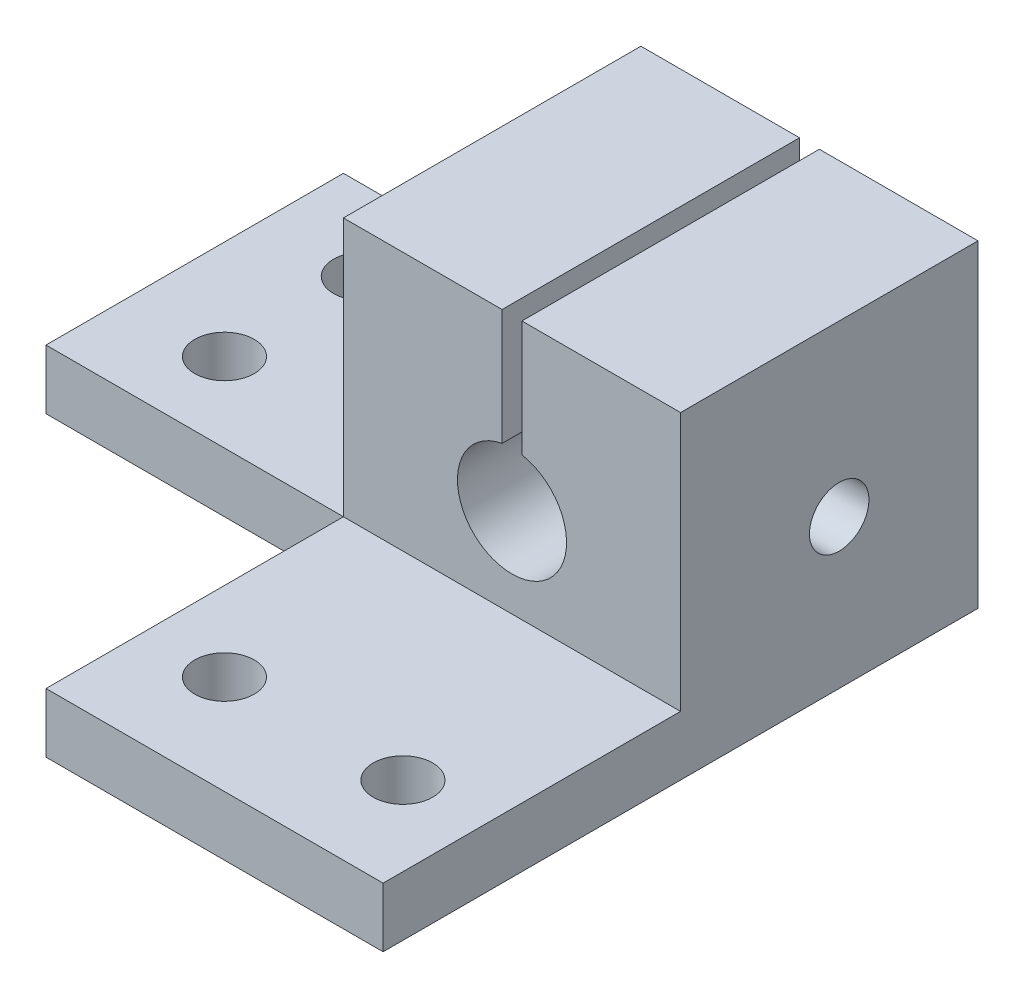
ISO-10303-21;
HEADER;
FILE_DESCRIPTION(('STEP AP214'),'2;1');
FILE_NAME('part.step','',(''),(''),'','','');
FILE_SCHEMA(('AUTOMOTIVE_DESIGN { 1 0 10303 214 1 1 1 1 }'));
ENDSEC;
DATA;
#1=APPLICATION_CONTEXT('core data for automotive mechanical design processes');
#2=APPLICATION_PROTOCOL_DEFINITION('international standard','automotive_design',2000,#1);
#3=PRODUCT_CONTEXT('',#1,'mechanical');
#4=PRODUCT('Part','Part','',(#3));
#5=PRODUCT_RELATED_PRODUCT_CATEGORY('part','',(#4));
#6=PRODUCT_DEFINITION_FORMATION('','',#4);
#7=PRODUCT_DEFINITION_CONTEXT('part definition',#1,'design');
#8=PRODUCT_DEFINITION('design','',#6,#7);
#9=PRODUCT_DEFINITION_SHAPE('','',#8);
#10=(LENGTH_UNIT() NAMED_UNIT(*) SI_UNIT(.MILLI.,.METRE.));
#11=(NAMED_UNIT(*) PLANE_ANGLE_UNIT() SI_UNIT($,.RADIAN.));
#12=(NAMED_UNIT(*) SI_UNIT($,.STERADIAN.) SOLID_ANGLE_UNIT());
#13=UNCERTAINTY_MEASURE_WITH_UNIT(LENGTH_MEASURE(1.E-05),#10,'distance_accuracy_value','');
#14=(GEOMETRIC_REPRESENTATION_CONTEXT(3) GLOBAL_UNCERTAINTY_ASSIGNED_CONTEXT((#13)) GLOBAL_UNIT_ASSIGNED_CONTEXT((#10,
#11,#12)) REPRESENTATION_CONTEXT('',''));
#15=CARTESIAN_POINT('',(0.,0.,0.));
#16=DIRECTION('',(0.,0.,1.));
#17=DIRECTION('',(1.,0.,0.));
#18=AXIS2_PLACEMENT_3D('',#15,#16,#17);
#19=CARTESIAN_POINT('',(-8.5,20.,0.));
#20=DIRECTION('',(-1.,0.,0.));
#21=DIRECTION('',(0.,0.,1.));
#22=AXIS2_PLACEMENT_3D('',#19,#20,#21);
#23=PLANE('',#22);
#24=DIRECTION('',(0.,0.,-1.));
#25=VECTOR('',#24,1.);
#26=CARTESIAN_POINT('',(-8.5,3.,-7.5));
#27=LINE('',#26,#25);
#28=CARTESIAN_POINT('',(-8.5,3.,7.5));
#29=VERTEX_POINT('',#28);
#30=CARTESIAN_POINT('',(-8.5,3.,-7.5));
#31=VERTEX_POINT('',#30);
#32=EDGE_CURVE('E153',#29,#31,#27,.T.);
#33=ORIENTED_EDGE('',*,*,#32,.F.);
#34=DIRECTION('',(0.,-1.,0.));
#35=VECTOR('',#34,1.);
#36=CARTESIAN_POINT('',(-8.5,20.,7.5));
#37=LINE('',#36,#35);
#38=CARTESIAN_POINT('',(-8.5,16.051646402671,7.5));
#39=VERTEX_POINT('',#38);
#40=EDGE_CURVE('E230',#39,#29,#37,.T.);
#41=ORIENTED_EDGE('',*,*,#40,.F.);
#42=DIRECTION('',(0.,0.,1.));
#43=VECTOR('',#42,1.);
#44=CARTESIAN_POINT('',(-8.5,16.051646402671,-27.5));
#45=LINE('',#44,#43);
#46=CARTESIAN_POINT('',(-8.5,16.051646402671,-7.5));
#47=VERTEX_POINT('',#46);
#48=EDGE_CURVE('E184',#47,#39,#45,.T.);
#49=ORIENTED_EDGE('',*,*,#48,.F.);
#50=DIRECTION('',(0.,-1.,0.));
#51=VECTOR('',#50,1.);
#52=CARTESIAN_POINT('',(-8.5,20.,-7.5));
#53=LINE('',#52,#51);
#54=EDGE_CURVE('E61',#47,#31,#53,.T.);
#55=ORIENTED_EDGE('',*,*,#54,.T.);
#56=EDGE_LOOP('',(#33,#41,#49,#55));
#57=FACE_BOUND('',#56,.T.);
#58=CARTESIAN_POINT('',(-8.5,7.5,-0.499999999999999));
#59=DIRECTION('',(-1.,0.,0.));
#60=DIRECTION('',(0.,0.,1.));
#61=AXIS2_PLACEMENT_3D('',#58,#59,#60);
#62=CIRCLE('',#61,1.5);
#63=CARTESIAN_POINT('',(-8.5,7.5,1.));
#64=VERTEX_POINT('',#63);
#65=EDGE_CURVE('E196',#64,#64,#62,.T.);
#66=ORIENTED_EDGE('',*,*,#65,.F.);
#67=EDGE_LOOP('',(#66));
#68=FACE_BOUND('',#67,.T.);
#69=ADVANCED_FACE('F36',(#57,#68),#23,.T.);
#70=CARTESIAN_POINT('',(0.,20.,7.5));
#71=DIRECTION('',(0.,0.,-1.));
#72=DIRECTION('',(-1.,0.,0.));
#73=AXIS2_PLACEMENT_3D('',#70,#71,#72);
#74=PLANE('',#73);
#75=DIRECTION('',(-1.,0.,0.));
#76=VECTOR('',#75,1.);
#77=CARTESIAN_POINT('',(8.5,3.,7.5));
#78=LINE('',#77,#76);
#79=CARTESIAN_POINT('',(8.5,3.,7.5));
#80=VERTEX_POINT('',#79);
#81=EDGE_CURVE('E154',#80,#29,#78,.T.);
#82=ORIENTED_EDGE('',*,*,#81,.F.);
#83=DIRECTION('',(0.,-1.,0.));
#84=VECTOR('',#83,1.);
#85=CARTESIAN_POINT('',(8.5,20.,7.5));
#86=LINE('',#85,#84);
#87=CARTESIAN_POINT('',(8.5,16.051646402671,7.5));
#88=VERTEX_POINT('',#87);
#89=EDGE_CURVE('E236',#88,#80,#86,.T.);
#90=ORIENTED_EDGE('',*,*,#89,.F.);
#91=DIRECTION('',(-1.,0.,0.));
#92=VECTOR('',#91,1.);
#93=CARTESIAN_POINT('',(0.,16.051646402671,7.5));
#94=LINE('',#93,#92);
#95=CARTESIAN_POINT('',(0.499999999999999,16.051646402671,7.5));
#96=VERTEX_POINT('',#95);
#97=EDGE_CURVE('E180',#88,#96,#94,.T.);
#98=ORIENTED_EDGE('',*,*,#97,.T.);
#99=DIRECTION('',(0.,-1.,0.));
#100=VECTOR('',#99,1.);
#101=CARTESIAN_POINT('',(0.499999999999999,20.,7.5));
#102=LINE('',#101,#100);
#103=CARTESIAN_POINT('',(0.499999999999999,10.204163456598,7.5));
#104=VERTEX_POINT('',#103);
#105=EDGE_CURVE('E219',#96,#104,#102,.T.);
#106=ORIENTED_EDGE('',*,*,#105,.T.);
#107=CARTESIAN_POINT('',(0.,7.5,7.5));
#108=DIRECTION('',(0.,0.,-1.));
#109=DIRECTION('',(-1.,0.,0.));
#110=AXIS2_PLACEMENT_3D('',#107,#108,#109);
#111=CIRCLE('',#110,2.75);
#112=CARTESIAN_POINT('',(-0.499999999999999,10.204163456598,7.5));
#113=VERTEX_POINT('',#112);
#114=EDGE_CURVE('E221',#104,#113,#111,.T.);
#115=ORIENTED_EDGE('',*,*,#114,.T.);
#116=DIRECTION('',(0.,-1.,0.));
#117=VECTOR('',#116,1.);
#118=CARTESIAN_POINT('',(-0.500000000000002,20.,7.5));
#119=LINE('',#118,#117);
#120=CARTESIAN_POINT('',(-0.500000000000001,16.051646402671,7.5));
#121=VERTEX_POINT('',#120);
#122=EDGE_CURVE('E215',#121,#113,#119,.T.);
#123=ORIENTED_EDGE('',*,*,#122,.F.);
#124=DIRECTION('',(-1.,0.,0.));
#125=VECTOR('',#124,1.);
#126=CARTESIAN_POINT('',(0.,16.051646402671,7.5));
#127=LINE('',#126,#125);
#128=EDGE_CURVE('E179',#121,#39,#127,.T.);
#129=ORIENTED_EDGE('',*,*,#128,.T.);
#130=ORIENTED_EDGE('',*,*,#40,.T.);
#131=EDGE_LOOP('',(#82,#90,#98,#106,#115,#123,#129,#130));
#132=FACE_BOUND('',#131,.T.);
#133=ADVANCED_FACE('F38',(#132),#74,.F.);
#134=CARTESIAN_POINT('',(8.5,20.,0.));
#135=DIRECTION('',(-1.,0.,0.));
#136=DIRECTION('',(0.,0.,1.));
#137=AXIS2_PLACEMENT_3D('',#134,#135,#136);
#138=PLANE('',#137);
#139=CARTESIAN_POINT('',(8.5,7.5,-0.499999999999999));
#140=DIRECTION('',(-1.,0.,0.));
#141=DIRECTION('',(0.,0.,1.));
#142=AXIS2_PLACEMENT_3D('',#139,#140,#141);
#143=CIRCLE('',#142,1.5);
#144=CARTESIAN_POINT('',(8.5,7.5,1.));
#145=VERTEX_POINT('',#144);
#146=EDGE_CURVE('E200',#145,#145,#143,.T.);
#147=ORIENTED_EDGE('',*,*,#146,.T.);
#148=EDGE_LOOP('',(#147));
#149=FACE_BOUND('',#148,.T.);
#150=DIRECTION('',(0.,0.,1.));
#151=VECTOR('',#150,1.);
#152=CARTESIAN_POINT('',(8.5,16.051646402671,-27.5));
#153=LINE('',#152,#151);
#154=CARTESIAN_POINT('',(8.5,16.051646402671,-7.5));
#155=VERTEX_POINT('',#154);
#156=EDGE_CURVE('E183',#155,#88,#153,.T.);
#157=ORIENTED_EDGE('',*,*,#156,.T.);
#158=ORIENTED_EDGE('',*,*,#89,.T.);
#159=DIRECTION('',(0.,0.,-1.));
#160=VECTOR('',#159,1.);
#161=CARTESIAN_POINT('',(8.5,3.,22.5));
#162=LINE('',#161,#160);
#163=CARTESIAN_POINT('',(8.5,3.,22.5));
#164=VERTEX_POINT('',#163);
#165=EDGE_CURVE('E176',#164,#80,#162,.T.);
#166=ORIENTED_EDGE('',*,*,#165,.F.);
#167=DIRECTION('',(0.,1.,0.));
#168=VECTOR('',#167,1.);
#169=CARTESIAN_POINT('',(8.5,0.,22.5));
#170=LINE('',#169,#168);
#171=CARTESIAN_POINT('',(8.5,0.,22.5));
#172=VERTEX_POINT('',#171);
#173=EDGE_CURVE('E167',#172,#164,#170,.T.);
#174=ORIENTED_EDGE('',*,*,#173,.F.);
#175=DIRECTION('',(0.,0.,-1.));
#176=VECTOR('',#175,1.);
#177=CARTESIAN_POINT('',(8.5,0.,0.));
#178=LINE('',#177,#176);
#179=CARTESIAN_POINT('',(8.5,0.,-7.5));
#180=VERTEX_POINT('',#179);
#181=EDGE_CURVE('E224',#172,#180,#178,.T.);
#182=ORIENTED_EDGE('',*,*,#181,.T.);
#183=DIRECTION('',(0.,-1.,0.));
#184=VECTOR('',#183,1.);
#185=CARTESIAN_POINT('',(8.5,20.,-7.5));
#186=LINE('',#185,#184);
#187=EDGE_CURVE('E234',#155,#180,#186,.T.);
#188=ORIENTED_EDGE('',*,*,#187,.F.);
#189=EDGE_LOOP('',(#157,#158,#166,#174,#182,#188));
#190=FACE_BOUND('',#189,.T.);
#191=ADVANCED_FACE('F282',(#149,#190),#138,.F.);
#192=CARTESIAN_POINT('',(0.,20.,-7.5));
#193=DIRECTION('',(0.,0.,-1.));
#194=DIRECTION('',(-1.,0.,0.));
#195=AXIS2_PLACEMENT_3D('',#192,#193,#194);
#196=PLANE('',#195);
#197=DIRECTION('',(0.,-1.,0.));
#198=VECTOR('',#197,1.);
#199=CARTESIAN_POINT('',(0.499999999999999,0.,-7.5));
#200=LINE('',#199,#198);
#201=CARTESIAN_POINT('',(0.499999999999999,16.051646402671,-7.5));
#202=VERTEX_POINT('',#201);
#203=CARTESIAN_POINT('',(0.499999999999999,10.204163456598,-7.5));
#204=VERTEX_POINT('',#203);
#205=EDGE_CURVE('E209',#202,#204,#200,.T.);
#206=ORIENTED_EDGE('',*,*,#205,.F.);
#207=DIRECTION('',(1.,0.,0.));
#208=VECTOR('',#207,1.);
#209=CARTESIAN_POINT('',(0.,16.051646402671,-7.5));
#210=LINE('',#209,#208);
#211=EDGE_CURVE('E193',#202,#155,#210,.T.);
#212=ORIENTED_EDGE('',*,*,#211,.T.);
#213=ORIENTED_EDGE('',*,*,#187,.T.);
#214=DIRECTION('',(1.,0.,0.));
#215=VECTOR('',#214,1.);
#216=CARTESIAN_POINT('',(0.,0.,-7.5));
#217=LINE('',#216,#215);
#218=CARTESIAN_POINT('',(-23.5,0.,-7.5));
#219=VERTEX_POINT('',#218);
#220=EDGE_CURVE('E138',#219,#180,#217,.T.);
#221=ORIENTED_EDGE('',*,*,#220,.F.);
#222=DIRECTION('',(0.,-1.,0.));
#223=VECTOR('',#222,1.);
#224=CARTESIAN_POINT('',(-23.5,0.,-7.5));
#225=LINE('',#224,#223);
#226=CARTESIAN_POINT('',(-23.5,3.,-7.5));
#227=VERTEX_POINT('',#226);
#228=EDGE_CURVE('E130',#227,#219,#225,.T.);
#229=ORIENTED_EDGE('',*,*,#228,.F.);
#230=DIRECTION('',(1.,0.,0.));
#231=VECTOR('',#230,1.);
#232=CARTESIAN_POINT('',(-23.5,3.,-7.5));
#233=LINE('',#232,#231);
#234=EDGE_CURVE('E135',#227,#31,#233,.T.);
#235=ORIENTED_EDGE('',*,*,#234,.T.);
#236=ORIENTED_EDGE('',*,*,#54,.F.);
#237=DIRECTION('',(1.,0.,0.));
#238=VECTOR('',#237,1.);
#239=CARTESIAN_POINT('',(0.,16.051646402671,-7.5));
#240=LINE('',#239,#238);
#241=CARTESIAN_POINT('',(-0.500000000000001,16.051646402671,-7.5));
#242=VERTEX_POINT('',#241);
#243=EDGE_CURVE('E187',#47,#242,#240,.T.);
#244=ORIENTED_EDGE('',*,*,#243,.T.);
#245=DIRECTION('',(0.,-1.,0.));
#246=VECTOR('',#245,1.);
#247=CARTESIAN_POINT('',(-0.499999999999996,0.,-7.5));
#248=LINE('',#247,#246);
#249=CARTESIAN_POINT('',(-0.499999999999999,10.204163456598,-7.5));
#250=VERTEX_POINT('',#249);
#251=EDGE_CURVE('E207',#242,#250,#248,.T.);
#252=ORIENTED_EDGE('',*,*,#251,.T.);
#253=CARTESIAN_POINT('',(0.,7.5,-7.5));
#254=DIRECTION('',(0.,0.,-1.));
#255=DIRECTION('',(-1.,0.,0.));
#256=AXIS2_PLACEMENT_3D('',#253,#254,#255);
#257=CIRCLE('',#256,2.75);
#258=EDGE_CURVE('E203',#204,#250,#257,.T.);
#259=ORIENTED_EDGE('',*,*,#258,.F.);
#260=EDGE_LOOP('',(#206,#212,#213,#221,#229,#235,#236,#244,#252,#259));
#261=FACE_BOUND('',#260,.T.);
#262=ADVANCED_FACE('F133',(#261),#196,.T.);
#263=DIRECTION('',(0.,1.,0.));
#264=VECTOR('',#263,1.);
#265=CARTESIAN_POINT('',(-8.5,3.,7.5));
#266=LINE('',#265,#264);
#267=CARTESIAN_POINT('',(-8.5,0.,7.5));
#268=VERTEX_POINT('',#267);
#269=EDGE_CURVE('E53',#268,#29,#266,.T.);
#270=ORIENTED_EDGE('',*,*,#269,.F.);
#271=DIRECTION('',(0.,0.,-1.));
#272=VECTOR('',#271,1.);
#273=CARTESIAN_POINT('',(-8.5,0.,0.));
#274=LINE('',#273,#272);
#275=CARTESIAN_POINT('',(-8.5,0.,22.5));
#276=VERTEX_POINT('',#275);
#277=EDGE_CURVE('E228',#276,#268,#274,.T.);
#278=ORIENTED_EDGE('',*,*,#277,.F.);
#279=DIRECTION('',(0.,-1.,0.));
#280=VECTOR('',#279,1.);
#281=CARTESIAN_POINT('',(-8.5,3.,22.5));
#282=LINE('',#281,#280);
#283=CARTESIAN_POINT('',(-8.5,3.,22.5));
#284=VERTEX_POINT('',#283);
#285=EDGE_CURVE('E171',#284,#276,#282,.T.);
#286=ORIENTED_EDGE('',*,*,#285,.F.);
#287=DIRECTION('',(0.,0.,-1.));
#288=VECTOR('',#287,1.);
#289=CARTESIAN_POINT('',(-8.5,3.,22.5));
#290=LINE('',#289,#288);
#291=EDGE_CURVE('E173',#284,#29,#290,.T.);
#292=ORIENTED_EDGE('',*,*,#291,.T.);
#293=EDGE_LOOP('',(#270,#278,#286,#292));
#294=FACE_BOUND('',#293,.T.);
#295=ADVANCED_FACE('F267',(#294),#23,.T.);
#296=CARTESIAN_POINT('',(0.499999999999999,0.,12.5));
#297=DIRECTION('',(1.,0.,0.));
#298=DIRECTION('',(0.,1.,0.));
#299=AXIS2_PLACEMENT_3D('',#296,#297,#298);
#300=PLANE('',#299);
#301=DIRECTION('',(0.,0.,1.));
#302=VECTOR('',#301,1.);
#303=CARTESIAN_POINT('',(0.499999999999999,16.051646402671,12.5));
#304=LINE('',#303,#302);
#305=EDGE_CURVE('E12',#202,#96,#304,.T.);
#306=ORIENTED_EDGE('',*,*,#305,.F.);
#307=ORIENTED_EDGE('',*,*,#205,.T.);
#308=DIRECTION('',(0.,0.,-1.));
#309=VECTOR('',#308,1.);
#310=CARTESIAN_POINT('',(0.499999999999999,10.204163456598,12.5));
#311=LINE('',#310,#309);
#312=EDGE_CURVE('E212',#104,#204,#311,.T.);
#313=ORIENTED_EDGE('',*,*,#312,.F.);
#314=ORIENTED_EDGE('',*,*,#105,.F.);
#315=EDGE_LOOP('',(#306,#307,#313,#314));
#316=FACE_BOUND('',#315,.T.);
#317=ADVANCED_FACE('F263',(#316),#300,.F.);
#318=CARTESIAN_POINT('',(-0.499999999999996,0.,12.5));
#319=DIRECTION('',(1.,0.,0.));
#320=DIRECTION('',(0.,1.,0.));
#321=AXIS2_PLACEMENT_3D('',#318,#319,#320);
#322=PLANE('',#321);
#323=ORIENTED_EDGE('',*,*,#251,.F.);
#324=DIRECTION('',(0.,0.,1.));
#325=VECTOR('',#324,1.);
#326=CARTESIAN_POINT('',(-0.500000000000001,16.051646402671,12.5));
#327=LINE('',#326,#325);
#328=EDGE_CURVE('E45',#242,#121,#327,.T.);
#329=ORIENTED_EDGE('',*,*,#328,.T.);
#330=ORIENTED_EDGE('',*,*,#122,.T.);
#331=DIRECTION('',(0.,0.,-1.));
#332=VECTOR('',#331,1.);
#333=CARTESIAN_POINT('',(-0.499999999999999,10.204163456598,12.5));
#334=LINE('',#333,#332);
#335=EDGE_CURVE('E211',#113,#250,#334,.T.);
#336=ORIENTED_EDGE('',*,*,#335,.T.);
#337=EDGE_LOOP('',(#323,#329,#330,#336));
#338=FACE_BOUND('',#337,.T.);
#339=ADVANCED_FACE('F266',(#338),#322,.T.);
#340=CARTESIAN_POINT('',(0.,0.,0.));
#341=DIRECTION('',(0.,1.,0.));
#342=DIRECTION('',(0.,0.,1.));
#343=AXIS2_PLACEMENT_3D('',#340,#341,#342);
#344=PLANE('',#343);
#345=CARTESIAN_POINT('',(4.5,0.,17.5));
#346=DIRECTION('',(0.,-1.,0.));
#347=DIRECTION('',(0.,0.,-1.));
#348=AXIS2_PLACEMENT_3D('',#345,#346,#347);
#349=CIRCLE('',#348,1.5);
#350=CARTESIAN_POINT('',(4.5,0.,16.));
#351=VERTEX_POINT('',#350);
#352=EDGE_CURVE('E396',#351,#351,#349,.T.);
#353=ORIENTED_EDGE('',*,*,#352,.F.);
#354=EDGE_LOOP('',(#353));
#355=FACE_BOUND('',#354,.T.);
#356=CARTESIAN_POINT('',(-4.5,0.,17.5));
#357=DIRECTION('',(0.,-1.,0.));
#358=DIRECTION('',(0.,0.,-1.));
#359=AXIS2_PLACEMENT_3D('',#356,#357,#358);
#360=CIRCLE('',#359,1.5);
#361=CARTESIAN_POINT('',(-4.5,0.,16.));
#362=VERTEX_POINT('',#361);
#363=EDGE_CURVE('E393',#362,#362,#360,.T.);
#364=ORIENTED_EDGE('',*,*,#363,.F.);
#365=EDGE_LOOP('',(#364));
#366=FACE_BOUND('',#365,.T.);
#367=CARTESIAN_POINT('',(-18.5,0.,-3.5));
#368=DIRECTION('',(0.,-1.,0.));
#369=DIRECTION('',(0.,0.,-1.));
#370=AXIS2_PLACEMENT_3D('',#367,#368,#369);
#371=CIRCLE('',#370,1.5);
#372=CARTESIAN_POINT('',(-18.5,0.,-5.));
#373=VERTEX_POINT('',#372);
#374=EDGE_CURVE('E390',#373,#373,#371,.T.);
#375=ORIENTED_EDGE('',*,*,#374,.F.);
#376=EDGE_LOOP('',(#375));
#377=FACE_BOUND('',#376,.T.);
#378=CARTESIAN_POINT('',(-18.5,0.,3.5));
#379=DIRECTION('',(0.,-1.,0.));
#380=DIRECTION('',(0.,0.,-1.));
#381=AXIS2_PLACEMENT_3D('',#378,#379,#380);
#382=CIRCLE('',#381,1.5);
#383=CARTESIAN_POINT('',(-18.5,0.,2.));
#384=VERTEX_POINT('',#383);
#385=EDGE_CURVE('E356',#384,#384,#382,.T.);
#386=ORIENTED_EDGE('',*,*,#385,.F.);
#387=EDGE_LOOP('',(#386));
#388=FACE_BOUND('',#387,.T.);
#389=ORIENTED_EDGE('',*,*,#181,.F.);
#390=DIRECTION('',(1.,0.,0.));
#391=VECTOR('',#390,1.);
#392=CARTESIAN_POINT('',(-8.5,0.,22.5));
#393=LINE('',#392,#391);
#394=EDGE_CURVE('E158',#276,#172,#393,.T.);
#395=ORIENTED_EDGE('',*,*,#394,.F.);
#396=ORIENTED_EDGE('',*,*,#277,.T.);
#397=DIRECTION('',(1.,0.,0.));
#398=VECTOR('',#397,1.);
#399=CARTESIAN_POINT('',(-23.5,0.,7.5));
#400=LINE('',#399,#398);
#401=CARTESIAN_POINT('',(-23.5,0.,7.5));
#402=VERTEX_POINT('',#401);
#403=EDGE_CURVE('E155',#402,#268,#400,.T.);
#404=ORIENTED_EDGE('',*,*,#403,.F.);
#405=DIRECTION('',(0.,0.,1.));
#406=VECTOR('',#405,1.);
#407=CARTESIAN_POINT('',(-23.5,0.,7.5));
#408=LINE('',#407,#406);
#409=EDGE_CURVE('E141',#219,#402,#408,.T.);
#410=ORIENTED_EDGE('',*,*,#409,.F.);
#411=ORIENTED_EDGE('',*,*,#220,.T.);
#412=EDGE_LOOP('',(#389,#395,#396,#404,#410,#411));
#413=FACE_BOUND('',#412,.T.);
#414=ADVANCED_FACE('F270',(#355,#366,#377,#388,#413),#344,.F.);
#415=CARTESIAN_POINT('',(0.,7.5,12.5));
#416=DIRECTION('',(0.,0.,-1.));
#417=DIRECTION('',(-1.,0.,0.));
#418=AXIS2_PLACEMENT_3D('',#415,#416,#417);
#419=CYLINDRICAL_SURFACE('',#418,2.75);
#420=CARTESIAN_POINT('',(2.75,7.5,1.));
#421=CARTESIAN_POINT('',(2.74999553289391,7.4220270508408,0.999995036820674));
#422=CARTESIAN_POINT('',(2.74664984832556,7.34398823680063,0.993885034274786));
#423=CARTESIAN_POINT('',(2.73359531725478,7.19027258005787,0.969742314187782));
#424=CARTESIAN_POINT('',(2.72387746390221,7.11459923972906,0.951692720110077));
#425=CARTESIAN_POINT('',(2.69908175997792,6.96806040477277,0.904613769214734));
#426=CARTESIAN_POINT('',(2.68402590603009,6.8971765799675,0.875629440875726));
#427=CARTESIAN_POINT('',(2.64988699120144,6.76141624637264,0.8077689259114));
#428=CARTESIAN_POINT('',(2.63080379903718,6.69653993351553,0.768892416811621));
#429=CARTESIAN_POINT('',(2.58877435218394,6.56967137317771,0.679372893557068));
#430=CARTESIAN_POINT('',(2.56565357097934,6.5081759601769,0.628109118333411));
#431=CARTESIAN_POINT('',(2.51862762447079,6.39418614464205,0.516632188680352));
#432=CARTESIAN_POINT('',(2.49472176235856,6.34170001053448,0.456410906934984));
#433=CARTESIAN_POINT('',(2.44613124305119,6.24210519491563,0.321807798794306));
#434=CARTESIAN_POINT('',(2.42159402839635,6.19600411626677,0.246620289435558));
#435=CARTESIAN_POINT('',(2.37752741687072,6.11728165747247,0.0881331298715552));
#436=CARTESIAN_POINT('',(2.35799408630603,6.08464967647791,0.00483992330818433));
#437=CARTESIAN_POINT('',(2.32814537755157,6.03609717227609,-0.162263824607325));
#438=CARTESIAN_POINT('',(2.31732653409192,6.01925285487332,-0.245710755848717));
#439=CARTESIAN_POINT('',(2.30492353478053,6.00000826788416,-0.414884164073688));
#440=CARTESIAN_POINT('',(2.30332659165822,5.99758799747776,-0.500607318911514));
#441=CARTESIAN_POINT('',(2.30916059512703,6.00658671599147,-0.658093729852789));
#442=CARTESIAN_POINT('',(2.31528177670115,6.01599729077657,-0.730033785505485));
#443=CARTESIAN_POINT('',(2.33351887542567,6.04484424025798,-0.871088078763484));
#444=CARTESIAN_POINT('',(2.34563743072956,6.06428502725226,-0.940201058282962));
#445=CARTESIAN_POINT('',(2.37471884026675,6.11290843753231,-1.07555773868773));
#446=CARTESIAN_POINT('',(2.39178172165247,6.14229456611718,-1.14170579765983));
#447=CARTESIAN_POINT('',(2.42886159364227,6.2098009743962,-1.2684721974986));
#448=CARTESIAN_POINT('',(2.44887986910388,6.24792505691845,-1.32908811462556));
#449=CARTESIAN_POINT('',(2.49334307244702,6.33867823747908,-1.45294377982219));
#450=CARTESIAN_POINT('',(2.51799359501409,6.39263907029744,-1.51513758948288));
#451=CARTESIAN_POINT('',(2.56648691782871,6.51020620828936,-1.63007617121855));
#452=CARTESIAN_POINT('',(2.59032917374526,6.57381886162662,-1.68281467420527));
#453=CARTESIAN_POINT('',(2.63638937585234,6.7140381267654,-1.78063703725313));
#454=CARTESIAN_POINT('',(2.65840123043428,6.79122036013456,-1.82500120750568));
#455=CARTESIAN_POINT('',(2.69642211220391,6.95344422164659,-1.89972502136931));
#456=CARTESIAN_POINT('',(2.71243670343128,7.03847847319571,-1.93009765186634));
#457=CARTESIAN_POINT('',(2.73537507908384,7.20560314041774,-1.9731172515579));
#458=CARTESIAN_POINT('',(2.74300133491569,7.28724120881031,-1.98714119615107));
#459=CARTESIAN_POINT('',(2.75081609737275,7.45204814685527,-2.00150899650171));
#460=CARTESIAN_POINT('',(2.75100922913374,7.53521603236789,-2.00186135917102));
#461=CARTESIAN_POINT('',(2.74429233918013,7.69220394198291,-1.98951638051903));
#462=CARTESIAN_POINT('',(2.73806095216361,7.76615627611883,-1.97806582935284));
#463=CARTESIAN_POINT('',(2.7201065477026,7.91090173026521,-1.94453446085424));
#464=CARTESIAN_POINT('',(2.70838297051789,7.98169452746372,-1.92245256001439));
#465=CARTESIAN_POINT('',(2.68013382891396,8.12007203330004,-1.8679082647443));
#466=CARTESIAN_POINT('',(2.6635032440995,8.18754432603544,-1.83521709435844));
#467=CARTESIAN_POINT('',(2.62692883380052,8.31622707762891,-1.76067804412777));
#468=CARTESIAN_POINT('',(2.60698377449004,8.37743519086002,-1.7188267525459));
#469=CARTESIAN_POINT('',(2.56300184221369,8.49907604776481,-1.62185100645769));
#470=CARTESIAN_POINT('',(2.5387564598654,8.55867122088779,-1.56576961471427));
#471=CARTESIAN_POINT('',(2.49032836693211,8.66805413999383,-1.44462690888345));
#472=CARTESIAN_POINT('',(2.46614574384712,8.71783196696366,-1.37955662451297));
#473=CARTESIAN_POINT('',(2.41863034974007,8.80981050679895,-1.23632105825382));
#474=CARTESIAN_POINT('',(2.39549649377281,8.85116579672796,-1.15754030877454));
#475=CARTESIAN_POINT('',(2.35557673325722,8.91962887927165,-0.992545312298827));
#476=CARTESIAN_POINT('',(2.33878162902652,8.94675734230938,-0.906342062936624));
#477=CARTESIAN_POINT('',(2.31576769108303,8.98328938456405,-0.737789012175135));
#478=CARTESIAN_POINT('',(2.30867825825265,8.99416166817435,-0.655881322941747));
#479=CARTESIAN_POINT('',(2.30343772372917,9.00223385888718,-0.491135232400116));
#480=CARTESIAN_POINT('',(2.30527941768142,8.99944478599832,-0.408297635011415));
#481=CARTESIAN_POINT('',(2.31670968294054,8.98170001222614,-0.255713288490515));
#482=CARTESIAN_POINT('',(2.32524317806448,8.96839952788391,-0.185682334973308));
#483=CARTESIAN_POINT('',(2.34762721988834,8.9323386957082,-0.0489956674915921));
#484=CARTESIAN_POINT('',(2.36147988599044,8.90957457682849,0.0176586890833149));
#485=CARTESIAN_POINT('',(2.39396641086271,8.85370854482785,0.150367755846729));
#486=CARTESIAN_POINT('',(2.41284421791643,8.8200513188859,0.216126851199319));
#487=CARTESIAN_POINT('',(2.45297719359377,8.74388744619949,0.341505330982647));
#488=CARTESIAN_POINT('',(2.47423362899283,8.701376073563,0.401121411081335));
#489=CARTESIAN_POINT('',(2.52062694545993,8.60110703838269,0.522078125252921));
#490=CARTESIAN_POINT('',(2.54585863647192,8.54201074304019,0.582278858180883));
#491=CARTESIAN_POINT('',(2.59453539642988,8.41409487950943,0.692287208793299));
#492=CARTESIAN_POINT('',(2.61797921165257,8.34526858307313,0.742087575142215));
#493=CARTESIAN_POINT('',(2.66139613447405,8.19687330645546,0.831199343214314));
#494=CARTESIAN_POINT('',(2.68123529430282,8.11703247318212,0.870127188200871));
#495=CARTESIAN_POINT('',(2.71414877932511,7.95059617944135,0.933472152452146));
#496=CARTESIAN_POINT('',(2.72724064660339,7.86401891505752,0.957926924663132));
#497=CARTESIAN_POINT('',(2.74071669432246,7.73035516522777,0.982926474999247));
#498=CARTESIAN_POINT('',(2.74418450271714,7.68459665053541,0.989315551652522));
#499=CARTESIAN_POINT('',(2.74882747533462,7.59256649478554,0.997853775806506));
#500=CARTESIAN_POINT('',(2.75000265225361,7.54629485657103,1.00000294678703));
#501=CARTESIAN_POINT('',(2.75,7.5,1.));
#502=B_SPLINE_CURVE_WITH_KNOTS('',3,(#420,#421,#422,#423,#424,#425,#426,#427,#428,#429,#430,
#431,#432,#433,#434,#435,#436,#437,#438,#439,#440,#441,#442,#443,#444,#445,#446,#447,#448,#449,
#450,#451,#452,#453,#454,#455,#456,#457,#458,#459,#460,#461,#462,#463,#464,#465,#466,#467,#468,
#469,#470,#471,#472,#473,#474,#475,#476,#477,#478,#479,#480,#481,#482,#483,#484,#485,#486,#487,
#488,#489,#490,#491,#492,#493,#494,#495,#496,#497,#498,#499,#500,#501),.UNSPECIFIED.,.T.,.F.,(4,
2,2,2,2,2,2,2,2,2,2,2,2,2,2,2,2,2,2,2,2,2,2,2,2,2,2,2,2,2,2,2,2,2,2,2,2,2,2,2,4),(0.,
0.233732365670662,0.467795818544868,0.700905752709472,0.934023286981207,1.18300734378139,
1.43221870235056,1.70547758592502,1.97852098918854,2.23435206692627,2.48982831886023,
2.70723672174195,2.92474084439227,3.14699566236442,3.36934739171625,3.62611318738823,
3.88304860020488,4.15667273405988,4.43004237689776,4.6781878937731,4.92617900379767,
5.15041519453526,5.37467424342679,5.60413212023295,5.83367560575034,6.08865618522294,
6.34389308070037,6.61822417400225,6.89215557446505,7.13941350036,7.38647200714689,
7.6009068270719,7.81542717649291,8.04330134656289,8.27129745737792,8.53429002491757,
8.79746534824315,9.06900285379735,9.33983078990054,9.47860540833467,9.61737925825842),.UNSPECIFIED.);
#503=CARTESIAN_POINT('',(2.75,7.5,1.));
#504=VERTEX_POINT('',#503);
#505=EDGE_CURVE('E204',#504,#504,#502,.T.);
#506=ORIENTED_EDGE('',*,*,#505,.T.);
#507=EDGE_LOOP('',(#506));
#508=FACE_BOUND('',#507,.T.);
#509=CARTESIAN_POINT('',(-2.75,7.5,1.));
#510=CARTESIAN_POINT('',(-2.74999553289391,7.5779729491592,0.999995036820674));
#511=CARTESIAN_POINT('',(-2.74664984832556,7.65601176319937,0.993885034274786));
#512=CARTESIAN_POINT('',(-2.73359531725477,7.80972741994213,0.969742314187782));
#513=CARTESIAN_POINT('',(-2.72387746390221,7.88540076027094,0.951692720110077));
#514=CARTESIAN_POINT('',(-2.69908175997792,8.03193959522723,0.904613769214734));
#515=CARTESIAN_POINT('',(-2.68402590603009,8.10282342003249,0.875629440875726));
#516=CARTESIAN_POINT('',(-2.64988699120144,8.23858375362736,0.8077689259114));
#517=CARTESIAN_POINT('',(-2.63080379903718,8.30346006648447,0.76889241681162));
#518=CARTESIAN_POINT('',(-2.58877435218394,8.43032862682229,0.679372893557068));
#519=CARTESIAN_POINT('',(-2.56565357097934,8.4918240398231,0.628109118333411));
#520=CARTESIAN_POINT('',(-2.51862762447079,8.60581385535795,0.516632188680351));
#521=CARTESIAN_POINT('',(-2.49472176235856,8.65829998946552,0.456410906934984));
#522=CARTESIAN_POINT('',(-2.44613124305119,8.75789480508437,0.321807798794305));
#523=CARTESIAN_POINT('',(-2.42159402839635,8.80399588373323,0.246620289435558));
#524=CARTESIAN_POINT('',(-2.37752741687072,8.88271834252753,0.0881331298715541));
#525=CARTESIAN_POINT('',(-2.35799408630603,8.91535032352209,0.00483992330818277));
#526=CARTESIAN_POINT('',(-2.32814537755157,8.96390282772392,-0.162263824607327));
#527=CARTESIAN_POINT('',(-2.31732653409192,8.98074714512668,-0.245710755848718));
#528=CARTESIAN_POINT('',(-2.30492353478053,8.99999173211584,-0.41488416407369));
#529=CARTESIAN_POINT('',(-2.30332659165822,9.00241200252224,-0.500607318911516));
#530=CARTESIAN_POINT('',(-2.30916059512703,8.99341328400853,-0.658093729852791));
#531=CARTESIAN_POINT('',(-2.31528177670115,8.98400270922343,-0.730033785505487));
#532=CARTESIAN_POINT('',(-2.33351887542567,8.95515575974201,-0.871088078763486));
#533=CARTESIAN_POINT('',(-2.34563743072956,8.93571497274773,-0.940201058282964));
#534=CARTESIAN_POINT('',(-2.37471884026675,8.88709156246769,-1.07555773868773));
#535=CARTESIAN_POINT('',(-2.39178172165247,8.85770543388282,-1.14170579765983));
#536=CARTESIAN_POINT('',(-2.42886159364227,8.7901990256038,-1.26847219749861));
#537=CARTESIAN_POINT('',(-2.44887986910388,8.75207494308155,-1.32908811462557));
#538=CARTESIAN_POINT('',(-2.49334307244702,8.66132176252092,-1.45294377982219));
#539=CARTESIAN_POINT('',(-2.51799359501409,8.60736092970256,-1.51513758948288));
#540=CARTESIAN_POINT('',(-2.56648691782871,8.48979379171064,-1.63007617121856));
#541=CARTESIAN_POINT('',(-2.59032917374526,8.42618113837338,-1.68281467420527));
#542=CARTESIAN_POINT('',(-2.63638937585234,8.2859618732346,-1.78063703725313));
#543=CARTESIAN_POINT('',(-2.65840123043428,8.20877963986544,-1.82500120750568));
#544=CARTESIAN_POINT('',(-2.69642211220391,8.04655577835341,-1.89972502136931));
#545=CARTESIAN_POINT('',(-2.71243670343128,7.96152152680429,-1.93009765186634));
#546=CARTESIAN_POINT('',(-2.73537507908384,7.79439685958225,-1.9731172515579));
#547=CARTESIAN_POINT('',(-2.74300133491569,7.71275879118968,-1.98714119615107));
#548=CARTESIAN_POINT('',(-2.75081609737275,7.54795185314472,-2.00150899650171));
#549=CARTESIAN_POINT('',(-2.75100922913374,7.46478396763211,-2.00186135917102));
#550=CARTESIAN_POINT('',(-2.74429233918013,7.30779605801709,-1.98951638051903));
#551=CARTESIAN_POINT('',(-2.73806095216361,7.23384372388117,-1.97806582935284));
#552=CARTESIAN_POINT('',(-2.7201065477026,7.08909826973479,-1.94453446085424));
#553=CARTESIAN_POINT('',(-2.70838297051789,7.01830547253628,-1.92245256001439));
#554=CARTESIAN_POINT('',(-2.68013382891396,6.87992796669995,-1.8679082647443));
#555=CARTESIAN_POINT('',(-2.6635032440995,6.81245567396456,-1.83521709435844));
#556=CARTESIAN_POINT('',(-2.62692883380052,6.68377292237109,-1.76067804412777));
#557=CARTESIAN_POINT('',(-2.60698377449004,6.62256480913998,-1.7188267525459));
#558=CARTESIAN_POINT('',(-2.56300184221369,6.50092395223519,-1.62185100645769));
#559=CARTESIAN_POINT('',(-2.5387564598654,6.44132877911221,-1.56576961471427));
#560=CARTESIAN_POINT('',(-2.49032836693211,6.33194586000617,-1.44462690888345));
#561=CARTESIAN_POINT('',(-2.46614574384712,6.28216803303634,-1.37955662451297));
#562=CARTESIAN_POINT('',(-2.41863034974007,6.19018949320105,-1.23632105825381));
#563=CARTESIAN_POINT('',(-2.39549649377281,6.14883420327204,-1.15754030877454));
#564=CARTESIAN_POINT('',(-2.35557673325722,6.08037112072834,-0.992545312298826));
#565=CARTESIAN_POINT('',(-2.33878162902652,6.05324265769062,-0.906342062936623));
#566=CARTESIAN_POINT('',(-2.31576769108303,6.01671061543595,-0.737789012175134));
#567=CARTESIAN_POINT('',(-2.30867825825265,6.00583833182565,-0.655881322941746));
#568=CARTESIAN_POINT('',(-2.30343772372917,5.99776614111282,-0.491135232400115));
#569=CARTESIAN_POINT('',(-2.30527941768142,6.00055521400168,-0.408297635011414));
#570=CARTESIAN_POINT('',(-2.31670968294054,6.01829998777386,-0.255713288490514));
#571=CARTESIAN_POINT('',(-2.32524317806448,6.03160047211609,-0.185682334973307));
#572=CARTESIAN_POINT('',(-2.34762721988834,6.0676613042918,-0.0489956674915905));
#573=CARTESIAN_POINT('',(-2.36147988599044,6.09042542317151,0.0176586890833159));
#574=CARTESIAN_POINT('',(-2.39396641086271,6.14629145517215,0.150367755846729));
#575=CARTESIAN_POINT('',(-2.41284421791643,6.1799486811141,0.216126851199319));
#576=CARTESIAN_POINT('',(-2.45297719359377,6.25611255380051,0.341505330982647));
#577=CARTESIAN_POINT('',(-2.47423362899283,6.29862392643699,0.401121411081335));
#578=CARTESIAN_POINT('',(-2.52062694545993,6.39889296161731,0.522078125252921));
#579=CARTESIAN_POINT('',(-2.54585863647192,6.45798925695981,0.582278858180884));
#580=CARTESIAN_POINT('',(-2.59453539642988,6.58590512049057,0.692287208793299));
#581=CARTESIAN_POINT('',(-2.61797921165257,6.65473141692687,0.742087575142215));
#582=CARTESIAN_POINT('',(-2.66139613447405,6.80312669354454,0.831199343214315));
#583=CARTESIAN_POINT('',(-2.68123529430282,6.88296752681788,0.870127188200871));
#584=CARTESIAN_POINT('',(-2.71414877932511,7.04940382055865,0.933472152452146));
#585=CARTESIAN_POINT('',(-2.72724064660339,7.13598108494248,0.957926924663131));
#586=CARTESIAN_POINT('',(-2.74071669432246,7.26964483477224,0.982926474999247));
#587=CARTESIAN_POINT('',(-2.74418450271714,7.31540334946459,0.989315551652522));
#588=CARTESIAN_POINT('',(-2.74882747533462,7.40743350521446,0.997853775806506));
#589=CARTESIAN_POINT('',(-2.75000265225361,7.45370514342897,1.00000294678703));
#590=CARTESIAN_POINT('',(-2.75,7.5,1.));
#591=B_SPLINE_CURVE_WITH_KNOTS('',3,(#509,#510,#511,#512,#513,#514,#515,#516,#517,#518,#519,
#520,#521,#522,#523,#524,#525,#526,#527,#528,#529,#530,#531,#532,#533,#534,#535,#536,#537,#538,
#539,#540,#541,#542,#543,#544,#545,#546,#547,#548,#549,#550,#551,#552,#553,#554,#555,#556,#557,
#558,#559,#560,#561,#562,#563,#564,#565,#566,#567,#568,#569,#570,#571,#572,#573,#574,#575,#576,
#577,#578,#579,#580,#581,#582,#583,#584,#585,#586,#587,#588,#589,#590),.UNSPECIFIED.,.T.,.F.,(4,
2,2,2,2,2,2,2,2,2,2,2,2,2,2,2,2,2,2,2,2,2,2,2,2,2,2,2,2,2,2,2,2,2,2,2,2,2,2,2,4),(0.,
0.233732365670663,0.467795818544869,0.700905752709472,0.934023286981207,1.18300734378139,
1.43221870235056,1.70547758592502,1.97852098918855,2.23435206692627,2.48982831886023,
2.70723672174195,2.92474084439228,3.14699566236442,3.36934739171625,3.62611318738823,
3.88304860020488,4.15667273405988,4.43004237689776,4.6781878937731,4.92617900379767,
5.15041519453526,5.37467424342679,5.60413212023295,5.83367560575034,6.08865618522294,
6.34389308070037,6.61822417400225,6.89215557446505,7.13941350036,7.38647200714689,
7.6009068270719,7.81542717649291,8.04330134656289,8.27129745737792,8.53429002491757,
8.79746534824315,9.06900285379735,9.33983078990054,9.47860540833467,9.61737925825842),.UNSPECIFIED.);
#592=CARTESIAN_POINT('',(-2.75,7.5,1.));
#593=VERTEX_POINT('',#592);
#594=EDGE_CURVE('E199',#593,#593,#591,.T.);
#595=ORIENTED_EDGE('',*,*,#594,.T.);
#596=EDGE_LOOP('',(#595));
#597=FACE_BOUND('',#596,.T.);
#598=ORIENTED_EDGE('',*,*,#312,.T.);
#599=ORIENTED_EDGE('',*,*,#258,.T.);
#600=ORIENTED_EDGE('',*,*,#335,.F.);
#601=ORIENTED_EDGE('',*,*,#114,.F.);
#602=EDGE_LOOP('',(#598,#599,#600,#601));
#603=FACE_BOUND('',#602,.T.);
#604=ADVANCED_FACE('F250',(#508,#597,#603),#419,.F.);
#605=CARTESIAN_POINT('',(11.5,7.5,-0.499999999999999));
#606=DIRECTION('',(-1.,0.,0.));
#607=DIRECTION('',(0.,0.,1.));
#608=AXIS2_PLACEMENT_3D('',#605,#606,#607);
#609=CYLINDRICAL_SURFACE('',#608,1.5);
#610=ORIENTED_EDGE('',*,*,#65,.T.);
#611=EDGE_LOOP('',(#610));
#612=FACE_BOUND('',#611,.T.);
#613=ORIENTED_EDGE('',*,*,#594,.F.);
#614=EDGE_LOOP('',(#613));
#615=FACE_BOUND('',#614,.T.);
#616=ADVANCED_FACE('F260',(#612,#615),#609,.F.);
#617=ORIENTED_EDGE('',*,*,#505,.F.);
#618=EDGE_LOOP('',(#617));
#619=FACE_BOUND('',#618,.T.);
#620=ORIENTED_EDGE('',*,*,#146,.F.);
#621=EDGE_LOOP('',(#620));
#622=FACE_BOUND('',#621,.T.);
#623=ADVANCED_FACE('F254',(#619,#622),#609,.F.);
#624=CARTESIAN_POINT('',(0.,16.051646402671,-27.5));
#625=DIRECTION('',(0.,1.,0.));
#626=DIRECTION('',(0.,0.,1.));
#627=AXIS2_PLACEMENT_3D('',#624,#625,#626);
#628=PLANE('',#627);
#629=ORIENTED_EDGE('',*,*,#48,.T.);
#630=ORIENTED_EDGE('',*,*,#128,.F.);
#631=ORIENTED_EDGE('',*,*,#328,.F.);
#632=ORIENTED_EDGE('',*,*,#243,.F.);
#633=EDGE_LOOP('',(#629,#630,#631,#632));
#634=FACE_BOUND('',#633,.T.);
#635=ADVANCED_FACE('F259',(#634),#628,.T.);
#636=CARTESIAN_POINT('',(0.,16.051646402671,-27.5));
#637=DIRECTION('',(0.,1.,0.));
#638=DIRECTION('',(0.,0.,1.));
#639=AXIS2_PLACEMENT_3D('',#636,#637,#638);
#640=PLANE('',#639);
#641=ORIENTED_EDGE('',*,*,#305,.T.);
#642=ORIENTED_EDGE('',*,*,#97,.F.);
#643=ORIENTED_EDGE('',*,*,#156,.F.);
#644=ORIENTED_EDGE('',*,*,#211,.F.);
#645=EDGE_LOOP('',(#641,#642,#643,#644));
#646=FACE_BOUND('',#645,.T.);
#647=ADVANCED_FACE('F336',(#646),#640,.T.);
#648=CARTESIAN_POINT('',(8.5,3.,22.5));
#649=DIRECTION('',(0.,-1.,0.));
#650=DIRECTION('',(1.,0.,0.));
#651=AXIS2_PLACEMENT_3D('',#648,#649,#650);
#652=PLANE('',#651);
#653=CARTESIAN_POINT('',(4.5,3.,17.5));
#654=DIRECTION('',(0.,-1.,0.));
#655=DIRECTION('',(1.,0.,0.));
#656=AXIS2_PLACEMENT_3D('',#653,#654,#655);
#657=CIRCLE('',#656,1.5);
#658=CARTESIAN_POINT('',(6.,3.,17.5));
#659=VERTEX_POINT('',#658);
#660=EDGE_CURVE('E40',#659,#659,#657,.T.);
#661=ORIENTED_EDGE('',*,*,#660,.T.);
#662=EDGE_LOOP('',(#661));
#663=FACE_BOUND('',#662,.T.);
#664=CARTESIAN_POINT('',(-4.5,3.,17.5));
#665=DIRECTION('',(0.,-1.,0.));
#666=DIRECTION('',(1.,0.,0.));
#667=AXIS2_PLACEMENT_3D('',#664,#665,#666);
#668=CIRCLE('',#667,1.5);
#669=CARTESIAN_POINT('',(-3.,3.,17.5));
#670=VERTEX_POINT('',#669);
#671=EDGE_CURVE('E358',#670,#670,#668,.T.);
#672=ORIENTED_EDGE('',*,*,#671,.T.);
#673=EDGE_LOOP('',(#672));
#674=FACE_BOUND('',#673,.T.);
#675=ORIENTED_EDGE('',*,*,#81,.T.);
#676=ORIENTED_EDGE('',*,*,#291,.F.);
#677=DIRECTION('',(-1.,0.,0.));
#678=VECTOR('',#677,1.);
#679=CARTESIAN_POINT('',(8.5,3.,22.5));
#680=LINE('',#679,#678);
#681=EDGE_CURVE('E169',#164,#284,#680,.T.);
#682=ORIENTED_EDGE('',*,*,#681,.F.);
#683=ORIENTED_EDGE('',*,*,#165,.T.);
#684=EDGE_LOOP('',(#675,#676,#682,#683));
#685=FACE_BOUND('',#684,.T.);
#686=ADVANCED_FACE('F306',(#663,#674,#685),#652,.F.);
#687=CARTESIAN_POINT('',(0.,0.,22.5));
#688=DIRECTION('',(0.,0.,1.));
#689=DIRECTION('',(1.,0.,0.));
#690=AXIS2_PLACEMENT_3D('',#687,#688,#689);
#691=PLANE('',#690);
#692=ORIENTED_EDGE('',*,*,#394,.T.);
#693=ORIENTED_EDGE('',*,*,#173,.T.);
#694=ORIENTED_EDGE('',*,*,#681,.T.);
#695=ORIENTED_EDGE('',*,*,#285,.T.);
#696=EDGE_LOOP('',(#692,#693,#694,#695));
#697=FACE_BOUND('',#696,.T.);
#698=ADVANCED_FACE('F312',(#697),#691,.T.);
#699=CARTESIAN_POINT('',(-23.5,3.,-7.5));
#700=DIRECTION('',(0.,-1.,0.));
#701=DIRECTION('',(0.,0.,-1.));
#702=AXIS2_PLACEMENT_3D('',#699,#700,#701);
#703=PLANE('',#702);
#704=CARTESIAN_POINT('',(-18.5,3.,-3.5));
#705=DIRECTION('',(0.,-1.,0.));
#706=DIRECTION('',(0.,0.,-1.));
#707=AXIS2_PLACEMENT_3D('',#704,#705,#706);
#708=CIRCLE('',#707,1.5);
#709=CARTESIAN_POINT('',(-18.5,3.,-5.));
#710=VERTEX_POINT('',#709);
#711=EDGE_CURVE('E355',#710,#710,#708,.T.);
#712=ORIENTED_EDGE('',*,*,#711,.T.);
#713=EDGE_LOOP('',(#712));
#714=FACE_BOUND('',#713,.T.);
#715=CARTESIAN_POINT('',(-18.5,3.,3.5));
#716=DIRECTION('',(0.,-1.,0.));
#717=DIRECTION('',(0.,0.,-1.));
#718=AXIS2_PLACEMENT_3D('',#715,#716,#717);
#719=CIRCLE('',#718,1.5);
#720=CARTESIAN_POINT('',(-18.5,3.,2.));
#721=VERTEX_POINT('',#720);
#722=EDGE_CURVE('E352',#721,#721,#719,.T.);
#723=ORIENTED_EDGE('',*,*,#722,.T.);
#724=EDGE_LOOP('',(#723));
#725=FACE_BOUND('',#724,.T.);
#726=ORIENTED_EDGE('',*,*,#32,.T.);
#727=ORIENTED_EDGE('',*,*,#234,.F.);
#728=DIRECTION('',(0.,0.,-1.));
#729=VECTOR('',#728,1.);
#730=CARTESIAN_POINT('',(-23.5,3.,-7.5));
#731=LINE('',#730,#729);
#732=CARTESIAN_POINT('',(-23.5,3.,7.5));
#733=VERTEX_POINT('',#732);
#734=EDGE_CURVE('E142',#733,#227,#731,.T.);
#735=ORIENTED_EDGE('',*,*,#734,.F.);
#736=DIRECTION('',(1.,0.,0.));
#737=VECTOR('',#736,1.);
#738=CARTESIAN_POINT('',(-23.5,3.,7.5));
#739=LINE('',#738,#737);
#740=EDGE_CURVE('E161',#733,#29,#739,.T.);
#741=ORIENTED_EDGE('',*,*,#740,.T.);
#742=EDGE_LOOP('',(#726,#727,#735,#741));
#743=FACE_BOUND('',#742,.T.);
#744=ADVANCED_FACE('F152',(#714,#725,#743),#703,.F.);
#745=CARTESIAN_POINT('',(-23.5,3.,7.5));
#746=DIRECTION('',(0.,0.,-1.));
#747=DIRECTION('',(-1.,0.,0.));
#748=AXIS2_PLACEMENT_3D('',#745,#746,#747);
#749=PLANE('',#748);
#750=ORIENTED_EDGE('',*,*,#269,.T.);
#751=ORIENTED_EDGE('',*,*,#740,.F.);
#752=DIRECTION('',(0.,1.,0.));
#753=VECTOR('',#752,1.);
#754=CARTESIAN_POINT('',(-23.5,3.,7.5));
#755=LINE('',#754,#753);
#756=EDGE_CURVE('E147',#402,#733,#755,.T.);
#757=ORIENTED_EDGE('',*,*,#756,.F.);
#758=ORIENTED_EDGE('',*,*,#403,.T.);
#759=EDGE_LOOP('',(#750,#751,#757,#758));
#760=FACE_BOUND('',#759,.T.);
#761=ADVANCED_FACE('F320',(#760),#749,.F.);
#762=CARTESIAN_POINT('',(-23.5,0.,0.));
#763=DIRECTION('',(1.,0.,0.));
#764=DIRECTION('',(0.,0.,-1.));
#765=AXIS2_PLACEMENT_3D('',#762,#763,#764);
#766=PLANE('',#765);
#767=ORIENTED_EDGE('',*,*,#734,.T.);
#768=ORIENTED_EDGE('',*,*,#228,.T.);
#769=ORIENTED_EDGE('',*,*,#409,.T.);
#770=ORIENTED_EDGE('',*,*,#756,.T.);
#771=EDGE_LOOP('',(#767,#768,#769,#770));
#772=FACE_BOUND('',#771,.T.);
#773=ADVANCED_FACE('F145',(#772),#766,.F.);
#774=CARTESIAN_POINT('',(-18.5,10.,3.5));
#775=DIRECTION('',(0.,-1.,0.));
#776=DIRECTION('',(0.,0.,-1.));
#777=AXIS2_PLACEMENT_3D('',#774,#775,#776);
#778=CYLINDRICAL_SURFACE('',#777,1.5);
#779=ORIENTED_EDGE('',*,*,#385,.T.);
#780=EDGE_LOOP('',(#779));
#781=FACE_BOUND('',#780,.T.);
#782=ORIENTED_EDGE('',*,*,#722,.F.);
#783=EDGE_LOOP('',(#782));
#784=FACE_BOUND('',#783,.T.);
#785=ADVANCED_FACE('F327',(#781,#784),#778,.F.);
#786=CARTESIAN_POINT('',(-18.5,10.,-3.5));
#787=DIRECTION('',(0.,-1.,0.));
#788=DIRECTION('',(0.,0.,-1.));
#789=AXIS2_PLACEMENT_3D('',#786,#787,#788);
#790=CYLINDRICAL_SURFACE('',#789,1.5);
#791=ORIENTED_EDGE('',*,*,#374,.T.);
#792=EDGE_LOOP('',(#791));
#793=FACE_BOUND('',#792,.T.);
#794=ORIENTED_EDGE('',*,*,#711,.F.);
#795=EDGE_LOOP('',(#794));
#796=FACE_BOUND('',#795,.T.);
#797=ADVANCED_FACE('F373',(#793,#796),#790,.F.);
#798=CARTESIAN_POINT('',(-4.5,10.,17.5));
#799=DIRECTION('',(0.,-1.,0.));
#800=DIRECTION('',(0.,0.,-1.));
#801=AXIS2_PLACEMENT_3D('',#798,#799,#800);
#802=CYLINDRICAL_SURFACE('',#801,1.5);
#803=ORIENTED_EDGE('',*,*,#363,.T.);
#804=EDGE_LOOP('',(#803));
#805=FACE_BOUND('',#804,.T.);
#806=ORIENTED_EDGE('',*,*,#671,.F.);
#807=EDGE_LOOP('',(#806));
#808=FACE_BOUND('',#807,.T.);
#809=ADVANCED_FACE('F367',(#805,#808),#802,.F.);
#810=CARTESIAN_POINT('',(4.5,10.,17.5));
#811=DIRECTION('',(0.,-1.,0.));
#812=DIRECTION('',(0.,0.,-1.));
#813=AXIS2_PLACEMENT_3D('',#810,#811,#812);
#814=CYLINDRICAL_SURFACE('',#813,1.5);
#815=ORIENTED_EDGE('',*,*,#352,.T.);
#816=EDGE_LOOP('',(#815));
#817=FACE_BOUND('',#816,.T.);
#818=ORIENTED_EDGE('',*,*,#660,.F.);
#819=EDGE_LOOP('',(#818));
#820=FACE_BOUND('',#819,.T.);
#821=ADVANCED_FACE('F365',(#817,#820),#814,.F.);
#822=CLOSED_SHELL('',(#69,#133,#191,#262,#295,#317,#339,#414,#604,#616,#623,#635,#647,#686,#698,
#744,#761,#773,#785,#797,#809,#821));
#823=MANIFOLD_SOLID_BREP('B2',#822);
#824=ADVANCED_BREP_SHAPE_REPRESENTATION('',(#18,#823),#14);
#825=SHAPE_DEFINITION_REPRESENTATION(#9,#824);
ENDSEC;
END-ISO-10303-21;
